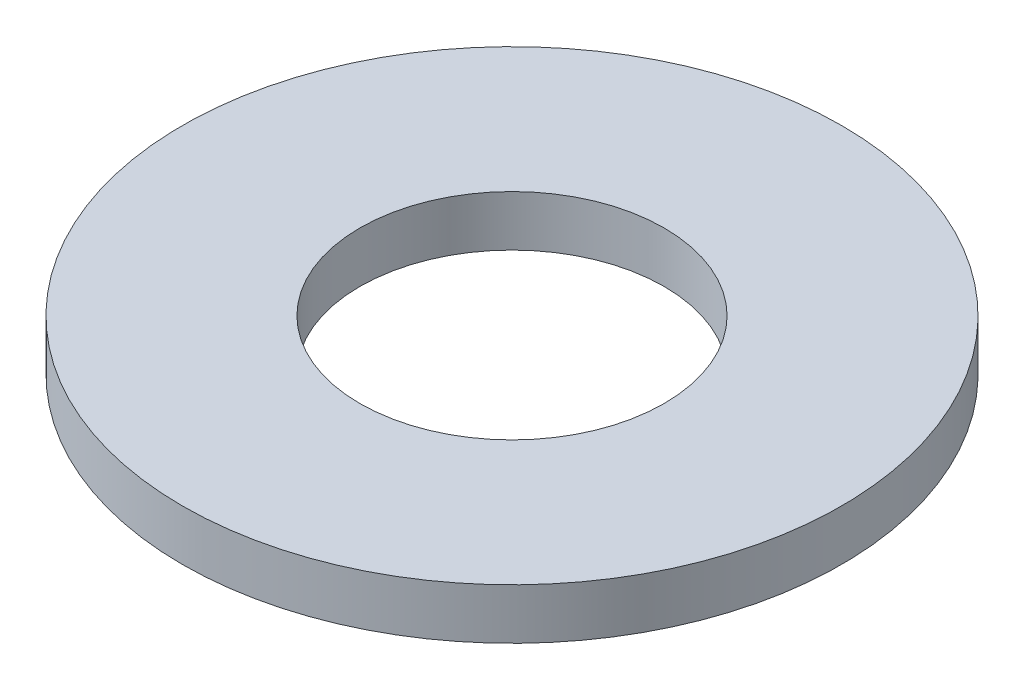
ISO-10303-21;
HEADER;
FILE_DESCRIPTION(('STEP AP214'),'2;1');
FILE_NAME('part.step','',(''),(''),'','','');
FILE_SCHEMA(('AUTOMOTIVE_DESIGN { 1 0 10303 214 1 1 1 1 }'));
ENDSEC;
DATA;
#1=APPLICATION_CONTEXT('core data for automotive mechanical design processes');
#2=APPLICATION_PROTOCOL_DEFINITION('international standard','automotive_design',2000,#1);
#3=PRODUCT_CONTEXT('',#1,'mechanical');
#4=PRODUCT('Part','Part','',(#3));
#5=PRODUCT_RELATED_PRODUCT_CATEGORY('part','',(#4));
#6=PRODUCT_DEFINITION_FORMATION('','',#4);
#7=PRODUCT_DEFINITION_CONTEXT('part definition',#1,'design');
#8=PRODUCT_DEFINITION('design','',#6,#7);
#9=PRODUCT_DEFINITION_SHAPE('','',#8);
#10=(LENGTH_UNIT() NAMED_UNIT(*) SI_UNIT(.MILLI.,.METRE.));
#11=(NAMED_UNIT(*) PLANE_ANGLE_UNIT() SI_UNIT($,.RADIAN.));
#12=(NAMED_UNIT(*) SI_UNIT($,.STERADIAN.) SOLID_ANGLE_UNIT());
#13=UNCERTAINTY_MEASURE_WITH_UNIT(LENGTH_MEASURE(1.E-05),#10,'distance_accuracy_value','');
#14=(GEOMETRIC_REPRESENTATION_CONTEXT(3) GLOBAL_UNCERTAINTY_ASSIGNED_CONTEXT((#13)) GLOBAL_UNIT_ASSIGNED_CONTEXT((#10,
#11,#12)) REPRESENTATION_CONTEXT('',''));
#15=CARTESIAN_POINT('',(0.,0.,0.));
#16=DIRECTION('',(0.,0.,1.));
#17=DIRECTION('',(1.,0.,0.));
#18=AXIS2_PLACEMENT_3D('',#15,#16,#17);
#19=CARTESIAN_POINT('',(0.,15.,0.));
#20=DIRECTION('',(0.,-1.,0.));
#21=DIRECTION('',(0.,0.,-1.));
#22=AXIS2_PLACEMENT_3D('',#19,#20,#21);
#23=CYLINDRICAL_SURFACE('',#22,97.5);
#24=CARTESIAN_POINT('',(0.,15.,0.));
#25=DIRECTION('',(0.,1.,0.));
#26=DIRECTION('',(0.,0.,1.));
#27=AXIS2_PLACEMENT_3D('',#24,#25,#26);
#28=CIRCLE('',#27,97.5);
#29=CARTESIAN_POINT('',(0.,15.,97.5));
#30=VERTEX_POINT('',#29);
#31=EDGE_CURVE('E10',#30,#30,#28,.T.);
#32=ORIENTED_EDGE('',*,*,#31,.F.);
#33=EDGE_LOOP('',(#32));
#34=FACE_BOUND('',#33,.T.);
#35=CARTESIAN_POINT('',(0.,0.,0.));
#36=DIRECTION('',(0.,1.,0.));
#37=DIRECTION('',(0.,0.,1.));
#38=AXIS2_PLACEMENT_3D('',#35,#36,#37);
#39=CIRCLE('',#38,97.5);
#40=CARTESIAN_POINT('',(0.,0.,97.5));
#41=VERTEX_POINT('',#40);
#42=EDGE_CURVE('E37',#41,#41,#39,.T.);
#43=ORIENTED_EDGE('',*,*,#42,.T.);
#44=EDGE_LOOP('',(#43));
#45=FACE_BOUND('',#44,.T.);
#46=ADVANCED_FACE('F40',(#34,#45),#23,.T.);
#47=CARTESIAN_POINT('',(0.,15.,0.));
#48=DIRECTION('',(0.,1.,0.));
#49=DIRECTION('',(0.,0.,1.));
#50=AXIS2_PLACEMENT_3D('',#47,#48,#49);
#51=PLANE('',#50);
#52=CARTESIAN_POINT('',(0.,15.,0.));
#53=DIRECTION('',(0.,1.,0.));
#54=DIRECTION('',(0.,0.,1.));
#55=AXIS2_PLACEMENT_3D('',#52,#53,#54);
#56=CIRCLE('',#55,45.);
#57=CARTESIAN_POINT('',(0.,15.,45.));
#58=VERTEX_POINT('',#57);
#59=EDGE_CURVE('E50',#58,#58,#56,.T.);
#60=ORIENTED_EDGE('',*,*,#59,.F.);
#61=EDGE_LOOP('',(#60));
#62=FACE_BOUND('',#61,.T.);
#63=ORIENTED_EDGE('',*,*,#31,.T.);
#64=EDGE_LOOP('',(#63));
#65=FACE_BOUND('',#64,.T.);
#66=ADVANCED_FACE('F59',(#62,#65),#51,.T.);
#67=CARTESIAN_POINT('',(0.,0.,0.));
#68=DIRECTION('',(0.,1.,0.));
#69=DIRECTION('',(0.,0.,1.));
#70=AXIS2_PLACEMENT_3D('',#67,#68,#69);
#71=PLANE('',#70);
#72=CARTESIAN_POINT('',(0.,0.,0.));
#73=DIRECTION('',(0.,1.,0.));
#74=DIRECTION('',(0.,0.,1.));
#75=AXIS2_PLACEMENT_3D('',#72,#73,#74);
#76=CIRCLE('',#75,45.);
#77=CARTESIAN_POINT('',(0.,0.,45.));
#78=VERTEX_POINT('',#77);
#79=EDGE_CURVE('E47',#78,#78,#76,.T.);
#80=ORIENTED_EDGE('',*,*,#79,.T.);
#81=EDGE_LOOP('',(#80));
#82=FACE_BOUND('',#81,.T.);
#83=ORIENTED_EDGE('',*,*,#42,.F.);
#84=EDGE_LOOP('',(#83));
#85=FACE_BOUND('',#84,.T.);
#86=ADVANCED_FACE('F58',(#82,#85),#71,.F.);
#87=CARTESIAN_POINT('',(0.,15.,0.));
#88=DIRECTION('',(0.,-1.,0.));
#89=DIRECTION('',(0.,0.,-1.));
#90=AXIS2_PLACEMENT_3D('',#87,#88,#89);
#91=CYLINDRICAL_SURFACE('',#90,45.);
#92=ORIENTED_EDGE('',*,*,#59,.T.);
#93=EDGE_LOOP('',(#92));
#94=FACE_BOUND('',#93,.T.);
#95=ORIENTED_EDGE('',*,*,#79,.F.);
#96=EDGE_LOOP('',(#95));
#97=FACE_BOUND('',#96,.T.);
#98=ADVANCED_FACE('F54',(#94,#97),#91,.F.);
#99=CLOSED_SHELL('',(#46,#66,#86,#98));
#100=MANIFOLD_SOLID_BREP('B2',#99);
#101=ADVANCED_BREP_SHAPE_REPRESENTATION('',(#18,#100),#14);
#102=SHAPE_DEFINITION_REPRESENTATION(#9,#101);
ENDSEC;
END-ISO-10303-21;
